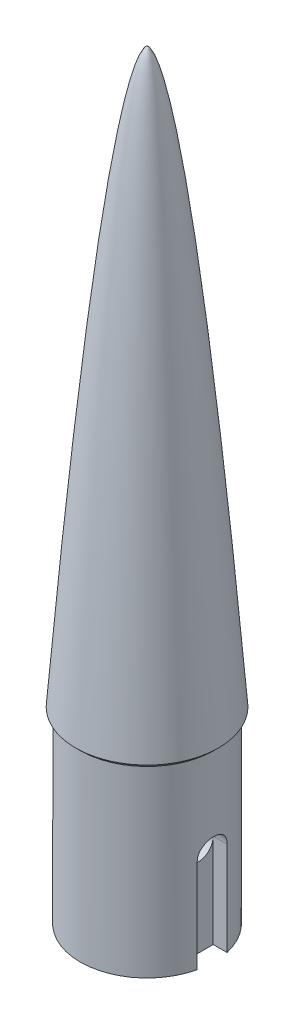
ISO-10303-21;
HEADER;
FILE_DESCRIPTION(('STEP AP214'),'2;1');
FILE_NAME('part.step','',(''),(''),'','','');
FILE_SCHEMA(('AUTOMOTIVE_DESIGN { 1 0 10303 214 1 1 1 1 }'));
ENDSEC;
DATA;
#1=APPLICATION_CONTEXT('core data for automotive mechanical design processes');
#2=APPLICATION_PROTOCOL_DEFINITION('international standard','automotive_design',2000,#1);
#3=PRODUCT_CONTEXT('',#1,'mechanical');
#4=PRODUCT('Part','Part','',(#3));
#5=PRODUCT_RELATED_PRODUCT_CATEGORY('part','',(#4));
#6=PRODUCT_DEFINITION_FORMATION('','',#4);
#7=PRODUCT_DEFINITION_CONTEXT('part definition',#1,'design');
#8=PRODUCT_DEFINITION('design','',#6,#7);
#9=PRODUCT_DEFINITION_SHAPE('','',#8);
#10=(LENGTH_UNIT() NAMED_UNIT(*) SI_UNIT(.MILLI.,.METRE.));
#11=(NAMED_UNIT(*) PLANE_ANGLE_UNIT() SI_UNIT($,.RADIAN.));
#12=(NAMED_UNIT(*) SI_UNIT($,.STERADIAN.) SOLID_ANGLE_UNIT());
#13=UNCERTAINTY_MEASURE_WITH_UNIT(LENGTH_MEASURE(1.E-05),#10,'distance_accuracy_value','');
#14=(GEOMETRIC_REPRESENTATION_CONTEXT(3) GLOBAL_UNCERTAINTY_ASSIGNED_CONTEXT((#13)) GLOBAL_UNIT_ASSIGNED_CONTEXT((#10,
#11,#12)) REPRESENTATION_CONTEXT('',''));
#15=CARTESIAN_POINT('',(0.,0.,0.));
#16=DIRECTION('',(0.,0.,1.));
#17=DIRECTION('',(1.,0.,0.));
#18=AXIS2_PLACEMENT_3D('',#15,#16,#17);
#19=CARTESIAN_POINT('',(0.,-25.,0.));
#20=DIRECTION('',(0.,1.,0.));
#21=DIRECTION('',(0.,0.,1.));
#22=AXIS2_PLACEMENT_3D('',#19,#20,#21);
#23=CYLINDRICAL_SURFACE('',#22,8.895);
#24=CARTESIAN_POINT('',(0.,-0.600000000000003,0.));
#25=DIRECTION('',(0.,-1.,0.));
#26=DIRECTION('',(0.,0.,-1.));
#27=AXIS2_PLACEMENT_3D('',#24,#25,#26);
#28=CIRCLE('',#27,8.895);
#29=CARTESIAN_POINT('',(0.,-0.600000000000003,-8.895));
#30=VERTEX_POINT('',#29);
#31=EDGE_CURVE('E11',#30,#30,#28,.T.);
#32=ORIENTED_EDGE('',*,*,#31,.T.);
#33=EDGE_LOOP('',(#32));
#34=FACE_BOUND('',#33,.T.);
#35=DIRECTION('',(0.,-1.,0.));
#36=VECTOR('',#35,1.);
#37=CARTESIAN_POINT('',(-8.67082930632215,-12.5,-1.98437499999999));
#38=LINE('',#37,#36);
#39=CARTESIAN_POINT('',(-8.67082930632215,-12.5,-1.984375));
#40=VERTEX_POINT('',#39);
#41=CARTESIAN_POINT('',(-8.67082930632215,-25.,-1.98437499999999));
#42=VERTEX_POINT('',#41);
#43=EDGE_CURVE('E210',#40,#42,#38,.T.);
#44=ORIENTED_EDGE('',*,*,#43,.F.);
#45=CARTESIAN_POINT('',(-8.895,-10.515625,0.));
#46=CARTESIAN_POINT('',(-8.89499798053136,-10.5156286782961,-0.110003108531044));
#47=CARTESIAN_POINT('',(-8.89293872905295,-10.5248028437771,-0.220050190385659));
#48=CARTESIAN_POINT('',(-8.88492294410009,-10.5612168017032,-0.437014773196951));
#49=CARTESIAN_POINT('',(-8.87896370197709,-10.5884691501126,-0.543930045069365));
#50=CARTESIAN_POINT('',(-8.86381097564101,-10.66014046251,-0.751464389222808));
#51=CARTESIAN_POINT('',(-8.85462093856362,-10.7045411348459,-0.852090038043748));
#52=CARTESIAN_POINT('',(-8.83399673910637,-10.809189812261,-1.04446068714721));
#53=CARTESIAN_POINT('',(-8.82256261666939,-10.8694375352822,-1.13620584545178));
#54=CARTESIAN_POINT('',(-8.79848845487047,-11.0051316026497,-1.30974205494041));
#55=CARTESIAN_POINT('',(-8.78583296110134,-11.0807914141361,-1.39136405863448));
#56=CARTESIAN_POINT('',(-8.76085045969245,-11.2447038420026,-1.54087074401027));
#57=CARTESIAN_POINT('',(-8.74852348238285,-11.332957616368,-1.60875416107165));
#58=CARTESIAN_POINT('',(-8.72544092397066,-11.520810939859,-1.72960902031442));
#59=CARTESIAN_POINT('',(-8.71470512331446,-11.6205296910602,-1.78239929438126));
#60=CARTESIAN_POINT('',(-8.69624278881732,-11.8277023668504,-1.87040686218199));
#61=CARTESIAN_POINT('',(-8.68851587956583,-11.9351553244818,-1.90562634832583));
#62=CARTESIAN_POINT('',(-8.67710379688232,-12.1529089981679,-1.95693151039241));
#63=CARTESIAN_POINT('',(-8.67335534128796,-12.2631356576469,-1.9733171227466));
#64=CARTESIAN_POINT('',(-8.67013460913494,-12.4848322544565,-1.98742225140913));
#65=CARTESIAN_POINT('',(-8.67066178498573,-12.5963020307519,-1.98514415802333));
#66=CARTESIAN_POINT('',(-8.6758755128654,-12.8150819521088,-1.96222763913715));
#67=CARTESIAN_POINT('',(-8.68048286491296,-12.9224308899092,-1.94193880078754));
#68=CARTESIAN_POINT('',(-8.69321246305035,-13.1321618701326,-1.88413107223078));
#69=CARTESIAN_POINT('',(-8.70133491344556,-13.2345436234669,-1.84661118050843));
#70=CARTESIAN_POINT('',(-8.72025684575896,-13.4324107413625,-1.75508849250558));
#71=CARTESIAN_POINT('',(-8.73107785800529,-13.5278322502844,-1.70095228060515));
#72=CARTESIAN_POINT('',(-8.75416459631689,-13.7083654708171,-1.57782741855743));
#73=CARTESIAN_POINT('',(-8.76643052669428,-13.7934757209513,-1.50883666682662));
#74=CARTESIAN_POINT('',(-8.79136402902234,-13.9529819654673,-1.35611581093398));
#75=CARTESIAN_POINT('',(-8.8040344247618,-14.0270934621295,-1.27208872607875));
#76=CARTESIAN_POINT('',(-8.82809796612522,-14.1602203300518,-1.09265382918496));
#77=CARTESIAN_POINT('',(-8.83949108676558,-14.2192354060537,-0.99724579460952));
#78=CARTESIAN_POINT('',(-8.85975573704167,-14.3205689320845,-0.797402322384055));
#79=CARTESIAN_POINT('',(-8.86862144653922,-14.3628489299928,-0.692946759215006));
#80=CARTESIAN_POINT('',(-8.88278925247284,-14.4291766978656,-0.478171595830713));
#81=CARTESIAN_POINT('',(-8.88809188846723,-14.4532272283998,-0.367852886206666));
#82=CARTESIAN_POINT('',(-8.89445888054048,-14.4819968395156,-0.146922244637292));
#83=CARTESIAN_POINT('',(-8.89560839126927,-14.487104381303,-0.0363632839080309));
#84=CARTESIAN_POINT('',(-8.89377875578923,-14.4788975892449,0.184028216567811));
#85=CARTESIAN_POINT('',(-8.8907999015053,-14.4655845579548,0.293860807125686));
#86=CARTESIAN_POINT('',(-8.88110209755264,-14.4212364374193,0.508386435136476));
#87=CARTESIAN_POINT('',(-8.87442639805636,-14.3904061793644,0.613123945630332));
#88=CARTESIAN_POINT('',(-8.85808259752387,-14.3121269856043,0.815940337496674));
#89=CARTESIAN_POINT('',(-8.84841423460527,-14.2646765954544,0.914018635217614));
#90=CARTESIAN_POINT('',(-8.82694819211914,-14.1537022358176,1.10233086452755));
#91=CARTESIAN_POINT('',(-8.81512120261388,-14.0899514567944,1.1924277186746));
#92=CARTESIAN_POINT('',(-8.79070766484064,-13.9484834474263,1.36078396392382));
#93=CARTESIAN_POINT('',(-8.77812101382286,-13.8707643249358,1.43904174866253));
#94=CARTESIAN_POINT('',(-8.75331093693519,-13.7017800928848,1.58304298834678));
#95=CARTESIAN_POINT('',(-8.74109914583823,-13.6102832900571,1.64851693602485));
#96=CARTESIAN_POINT('',(-8.71869698047453,-13.4173649355546,1.76317168339184));
#97=CARTESIAN_POINT('',(-8.70850651768816,-13.315943818784,1.81235319663538));
#98=CARTESIAN_POINT('',(-8.69140054463049,-13.1066041991113,1.89268852324433));
#99=CARTESIAN_POINT('',(-8.68446640876592,-12.9987267288714,1.92394509722755));
#100=CARTESIAN_POINT('',(-8.67462629679212,-12.7790753551192,1.96784118701104));
#101=CARTESIAN_POINT('',(-8.67171964652347,-12.6673021069317,1.98048381861487));
#102=CARTESIAN_POINT('',(-8.67030729710035,-12.4457524437848,1.9866564116767));
#103=CARTESIAN_POINT('',(-8.67170310734381,-12.3359883589578,1.98061409297813));
#104=CARTESIAN_POINT('',(-8.67851500496339,-12.1190849742809,1.95054750257742));
#105=CARTESIAN_POINT('',(-8.68393104095299,-12.0119456408994,1.92652346071756));
#106=CARTESIAN_POINT('',(-8.6981241844418,-11.8036893505729,1.86138575645093));
#107=CARTESIAN_POINT('',(-8.70688857054173,-11.7025512531436,1.82033672721598));
#108=CARTESIAN_POINT('',(-8.72679539432478,-11.5085347915276,1.72236893705458));
#109=CARTESIAN_POINT('',(-8.73793809113817,-11.4156573289467,1.66544844663638));
#110=CARTESIAN_POINT('',(-8.76163848646004,-11.238695474782,1.53594515186167));
#111=CARTESIAN_POINT('',(-8.77422098481682,-11.154836679788,1.46305855847869));
#112=CARTESIAN_POINT('',(-8.79921922589108,-11.0004001651611,1.30430465490752));
#113=CARTESIAN_POINT('',(-8.81163492929224,-10.9298255275292,1.21843434073407));
#114=CARTESIAN_POINT('',(-8.83510136371243,-10.8030382120514,1.03474108869537));
#115=CARTESIAN_POINT('',(-8.84613120897754,-10.7470341562857,0.936771332481138));
#116=CARTESIAN_POINT('',(-8.86537241774909,-10.6523773860926,0.732581640881906));
#117=CARTESIAN_POINT('',(-8.87358609932992,-10.6137103928671,0.626368579579056));
#118=CARTESIAN_POINT('',(-8.88483654653533,-10.5615673365609,0.43340420838887));
#119=CARTESIAN_POINT('',(-8.88862390497389,-10.5443723842688,0.347682052709739));
#120=CARTESIAN_POINT('',(-8.8937063738634,-10.5214000285145,0.174649120553264));
#121=CARTESIAN_POINT('',(-8.89500160338379,-10.5156220795683,0.0873384201749424));
#122=CARTESIAN_POINT('',(-8.895,-10.515625,0.));
#123=B_SPLINE_CURVE_WITH_KNOTS('',3,(#45,#46,#47,#48,#49,#50,#51,#52,#53,#54,#55,#56,#57,#58,
#59,#60,#61,#62,#63,#64,#65,#66,#67,#68,#69,#70,#71,#72,#73,#74,#75,#76,#77,#78,#79,#80,#81,#82,
#83,#84,#85,#86,#87,#88,#89,#90,#91,#92,#93,#94,#95,#96,#97,#98,#99,#100,#101,#102,#103,#104,
#105,#106,#107,#108,#109,#110,#111,#112,#113,#114,#115,#116,#117,#118,#119,#120,#121,#122),
.UNSPECIFIED.,.T.,.F.,(4,2,2,2,2,2,2,2,2,2,2,2,2,2,2,2,2,2,2,2,2,2,2,2,2,2,2,2,2,2,2,2,2,2,2,2,
2,2,4),(0.,0.32968958471569,0.659608391077071,0.989176249620352,1.31873824265806,
1.65322013476703,1.98773280154188,2.32610663322488,2.6644382334597,2.99730368340978,
3.33012650314447,3.65662716066737,3.98314679768962,4.31235992028412,4.64161964977686,
4.97829541698964,5.31497776845579,5.65242928429447,5.98982968812842,6.32027155964406,
6.65069006614927,6.9773221968005,7.30398291850589,7.63546294699817,7.96698791151875,
8.30488633992517,8.64276996754305,8.97869668766252,9.31456717032856,9.64280656540119,
9.97104176499135,10.2980421054524,10.6250780926347,10.9589814011184,11.2929620818613,
11.631489944489,11.9697384812382,12.2315123866697,12.493273784704),.UNSPECIFIED.);
#124=CARTESIAN_POINT('',(-8.67082930632215,-12.5,1.984375));
#125=VERTEX_POINT('',#124);
#126=EDGE_CURVE('E158',#125,#40,#123,.T.);
#127=ORIENTED_EDGE('',*,*,#126,.F.);
#128=DIRECTION('',(0.,-1.,0.));
#129=VECTOR('',#128,1.);
#130=CARTESIAN_POINT('',(-8.67082930632215,-12.5,1.984375));
#131=LINE('',#130,#129);
#132=CARTESIAN_POINT('',(-8.67082930632215,-25.,1.984375));
#133=VERTEX_POINT('',#132);
#134=EDGE_CURVE('E214',#125,#133,#131,.T.);
#135=ORIENTED_EDGE('',*,*,#134,.T.);
#136=CARTESIAN_POINT('',(0.,-25.,0.));
#137=DIRECTION('',(0.,1.,0.));
#138=DIRECTION('',(0.,0.,1.));
#139=AXIS2_PLACEMENT_3D('',#136,#137,#138);
#140=CIRCLE('',#139,8.895);
#141=CARTESIAN_POINT('',(8.67082930632215,-25.,1.984375));
#142=VERTEX_POINT('',#141);
#143=EDGE_CURVE('E223',#133,#142,#140,.T.);
#144=ORIENTED_EDGE('',*,*,#143,.T.);
#145=DIRECTION('',(0.,-1.,0.));
#146=VECTOR('',#145,1.);
#147=CARTESIAN_POINT('',(8.67082930632215,-12.5,1.984375));
#148=LINE('',#147,#146);
#149=CARTESIAN_POINT('',(8.67082930632215,-12.5,1.984375));
#150=VERTEX_POINT('',#149);
#151=EDGE_CURVE('E61',#150,#142,#148,.T.);
#152=ORIENTED_EDGE('',*,*,#151,.F.);
#153=CARTESIAN_POINT('',(8.67082930632215,-12.5,-1.984375));
#154=CARTESIAN_POINT('',(8.67083152693427,-12.3900352924012,-1.98437129476868));
#155=CARTESIAN_POINT('',(8.67294398159313,-12.2800265459929,-1.97520331559507));
#156=CARTESIAN_POINT('',(8.68114924080244,-12.0631415333078,-1.9388161542682));
#157=CARTESIAN_POINT('',(8.687244848201,-11.956267528248,-1.91158426077147));
#158=CARTESIAN_POINT('',(8.70269247518692,-11.748820633369,-1.83997273746253));
#159=CARTESIAN_POINT('',(8.71204083806803,-11.6482408168817,-1.79561235715901));
#160=CARTESIAN_POINT('',(8.73293623267991,-11.4559475998378,-1.69105869172377));
#161=CARTESIAN_POINT('',(8.74448323779282,-11.3642340919615,-1.63086559826731));
#162=CARTESIAN_POINT('',(8.76870152698746,-11.190664815864,-1.49522783567887));
#163=CARTESIAN_POINT('',(8.78138768085908,-11.1089875068265,-1.41955741552215));
#164=CARTESIAN_POINT('',(8.80632483899608,-10.959373320034,-1.25560020996667));
#165=CARTESIAN_POINT('',(8.81857580851969,-10.8914375372732,-1.16731242010812));
#166=CARTESIAN_POINT('',(8.8414245341093,-10.7705257147047,-0.979426653986215));
#167=CARTESIAN_POINT('',(8.85200269761223,-10.7177218091067,-0.879715314874414));
#168=CARTESIAN_POINT('',(8.87014575131516,-10.6296870280497,-0.672558617309702));
#169=CARTESIAN_POINT('',(8.8777109934971,-10.5944540997552,-0.56511416400382));
#170=CARTESIAN_POINT('',(8.88887072235122,-10.5431240620808,-0.347397468059264));
#171=CARTESIAN_POINT('',(8.89252784470798,-10.5267247747917,-0.237199733411299));
#172=CARTESIAN_POINT('',(8.89567645545256,-10.5125822573189,-0.0155605825450066));
#173=CARTESIAN_POINT('',(8.89516843879117,-10.5148368104668,0.0958806843305372));
#174=CARTESIAN_POINT('',(8.89009171695082,-10.5377139363359,0.31475870560092));
#175=CARTESIAN_POINT('',(8.88559503342556,-10.5580107416537,0.422231426260748));
#176=CARTESIAN_POINT('',(8.8731285194068,-10.6158765069307,0.63220575827785));
#177=CARTESIAN_POINT('',(8.86515852778899,-10.6534462681744,0.734707138772998));
#178=CARTESIAN_POINT('',(8.84652583210922,-10.7450763392216,0.932727372605715));
#179=CARTESIAN_POINT('',(8.83584323372576,-10.7992591265551,1.02818760316908));
#180=CARTESIAN_POINT('',(8.81295504188348,-10.9224856773742,1.2087789663073));
#181=CARTESIAN_POINT('',(8.80074923327929,-10.9915315411911,1.29390863638836));
#182=CARTESIAN_POINT('',(8.77584357058241,-11.1442943709138,1.45336071135604));
#183=CARTESIAN_POINT('',(8.76313874101006,-11.2282964215203,1.5274094616731));
#184=CARTESIAN_POINT('',(8.73891357366072,-11.4076579397835,1.66042127107666));
#185=CARTESIAN_POINT('',(8.72739327066983,-11.5030177408069,1.71938388720298));
#186=CARTESIAN_POINT('',(8.70682769295961,-11.7028425850512,1.82067818880462));
#187=CARTESIAN_POINT('',(8.69779041740815,-11.8073356589106,1.86295631105176));
#188=CARTESIAN_POINT('',(8.68332365321309,-12.022193123648,1.92926911648296));
#189=CARTESIAN_POINT('',(8.67789356668125,-12.1325565382453,1.95330682309304));
#190=CARTESIAN_POINT('',(8.67137842965835,-12.3535164219845,1.98202813124953));
#191=CARTESIAN_POINT('',(8.6702037566994,-12.4640584104577,1.98711100551234));
#192=CARTESIAN_POINT('',(8.67209039478514,-12.6844102825169,1.97886095731595));
#193=CARTESIAN_POINT('',(8.67515140212929,-12.7942202180243,1.96552935518464));
#194=CARTESIAN_POINT('',(8.68507970183092,-13.008588609668,1.92117571919051));
#195=CARTESIAN_POINT('',(8.69189929584423,-13.1131953191398,1.8903752346446));
#196=CARTESIAN_POINT('',(8.70853304572482,-13.3157631209793,1.81219878075513));
#197=CARTESIAN_POINT('',(8.71834749764175,-13.4137235551742,1.76482117265091));
#198=CARTESIAN_POINT('',(8.74006093984554,-13.6019411777236,1.65396154223488));
#199=CARTESIAN_POINT('',(8.75199070504297,-13.6920504352035,1.59023451518154));
#200=CARTESIAN_POINT('',(8.7765101984565,-13.8604425592094,1.4488041612309));
#201=CARTESIAN_POINT('',(8.78910001194908,-13.9387238925018,1.37109902523044));
#202=CARTESIAN_POINT('',(8.81381758079177,-14.0827966953209,1.20210799703321));
#203=CARTESIAN_POINT('',(8.82593157346983,-14.14831541272,1.11058721230565));
#204=CARTESIAN_POINT('',(8.84807556919855,-14.2630486894093,0.91760694147292));
#205=CARTESIAN_POINT('',(8.85810567158719,-14.3122640259399,0.816147929457443));
#206=CARTESIAN_POINT('',(8.87489393112164,-14.3926180815481,0.606815775294063));
#207=CARTESIAN_POINT('',(8.88167322724541,-14.423873857297,0.498989339167028));
#208=CARTESIAN_POINT('',(8.89128759699143,-14.4677855598397,0.279447263775833));
#209=CARTESIAN_POINT('',(8.89412326837703,-14.4804443055345,0.167732216568148));
#210=CARTESIAN_POINT('',(8.89551225388667,-14.4866716096712,-0.0538303410463871));
#211=CARTESIAN_POINT('',(8.89415677257247,-14.4806467378316,-0.1636660480899));
#212=CARTESIAN_POINT('',(8.88751206547856,-14.4505901194767,-0.380717396055891));
#213=CARTESIAN_POINT('',(8.88222291602629,-14.4265587223531,-0.487933087774485));
#214=CARTESIAN_POINT('',(8.86831291596493,-14.3613693329617,-0.696371660604404));
#215=CARTESIAN_POINT('',(8.85970370424092,-14.3202711322204,-0.797614067913526));
#216=CARTESIAN_POINT('',(8.84007111469181,-14.2221722616271,-0.991819184416284));
#217=CARTESIAN_POINT('',(8.82904749249992,-14.1651699819348,-1.08478105418124));
#218=CARTESIAN_POINT('',(8.80551621508588,-14.0355666300762,-1.26176241652204));
#219=CARTESIAN_POINT('',(8.79298364506869,-13.9626809241806,-1.34557017665365));
#220=CARTESIAN_POINT('',(8.76797805507896,-13.8039510336438,-1.49990415519922));
#221=CARTESIAN_POINT('',(8.7555050502752,-13.7181037126502,-1.57042714975871));
#222=CARTESIAN_POINT('',(8.73183513193552,-13.5344380779377,-1.69714603015807));
#223=CARTESIAN_POINT('',(8.72065858524308,-13.4364686619124,-1.75312694377475));
#224=CARTESIAN_POINT('',(8.7011051990314,-13.2322823615859,-1.84774053682795));
#225=CARTESIAN_POINT('',(8.69272603418347,-13.126072418212,-1.88638763425605));
#226=CARTESIAN_POINT('',(8.68123438698859,-12.9331580464439,-1.93848519859973));
#227=CARTESIAN_POINT('',(8.67735881646133,-12.847485490319,-1.95566030472962));
#228=CARTESIAN_POINT('',(8.67215546197685,-12.6745511498479,-1.97860637521381));
#229=CARTESIAN_POINT('',(8.67082754361105,-12.5872894495867,-1.98437794119458));
#230=CARTESIAN_POINT('',(8.67082930632215,-12.5,-1.984375));
#231=B_SPLINE_CURVE_WITH_KNOTS('',3,(#153,#154,#155,#156,#157,#158,#159,#160,#161,#162,#163,
#164,#165,#166,#167,#168,#169,#170,#171,#172,#173,#174,#175,#176,#177,#178,#179,#180,#181,#182,
#183,#184,#185,#186,#187,#188,#189,#190,#191,#192,#193,#194,#195,#196,#197,#198,#199,#200,#201,
#202,#203,#204,#205,#206,#207,#208,#209,#210,#211,#212,#213,#214,#215,#216,#217,#218,#219,#220,
#221,#222,#223,#224,#225,#226,#227,#228,#229,#230),.UNSPECIFIED.,.T.,.F.,(4,2,2,2,2,2,2,2,2,2,2,
2,2,2,2,2,2,2,2,2,2,2,2,2,2,2,2,2,2,2,2,2,2,2,2,2,2,2,4),(0.,0.329574133527324,
0.659380430494616,0.988817154975628,1.31824989138673,1.6528827972829,1.98754235792109,
2.32587008991828,2.66415828546683,2.99693943397993,3.32968103809655,3.65653406946799,
3.98340226493483,4.31274068542326,4.6421256759768,4.97863673959058,5.31515768273329,
5.65275035769749,5.99028706301795,6.32067223910689,6.65103372763026,6.97729620213301,
7.30359093900236,7.63509437723089,7.96664075087856,8.30464018838773,8.64262350993627,
8.97837818149084,9.31408195476448,9.64253221398148,9.97097610023751,10.2982789020109,
10.6256148460068,10.9593860612475,11.2932381697132,11.6317758832356,11.9700314818907,
12.2316596280387,12.4932739708748),.UNSPECIFIED.);
#232=CARTESIAN_POINT('',(8.67082930632215,-12.5,-1.984375));
#233=VERTEX_POINT('',#232);
#234=EDGE_CURVE('E131',#233,#150,#231,.T.);
#235=ORIENTED_EDGE('',*,*,#234,.F.);
#236=DIRECTION('',(0.,-1.,0.));
#237=VECTOR('',#236,1.);
#238=CARTESIAN_POINT('',(8.67082930632215,-12.5,-1.98437499999999));
#239=LINE('',#238,#237);
#240=CARTESIAN_POINT('',(8.67082930632215,-25.,-1.98437499999999));
#241=VERTEX_POINT('',#240);
#242=EDGE_CURVE('E173',#233,#241,#239,.T.);
#243=ORIENTED_EDGE('',*,*,#242,.T.);
#244=EDGE_CURVE('E213',#241,#42,#140,.T.);
#245=ORIENTED_EDGE('',*,*,#244,.T.);
#246=EDGE_LOOP('',(#44,#127,#135,#144,#152,#235,#243,#245));
#247=FACE_BOUND('',#246,.T.);
#248=ADVANCED_FACE('F45',(#34,#247),#23,.T.);
#249=CARTESIAN_POINT('',(0.,-25.,0.));
#250=DIRECTION('',(0.,1.,0.));
#251=DIRECTION('',(0.,0.,1.));
#252=AXIS2_PLACEMENT_3D('',#249,#250,#251);
#253=PLANE('',#252);
#254=DIRECTION('',(-1.,0.,0.));
#255=VECTOR('',#254,1.);
#256=CARTESIAN_POINT('',(6.83125,-25.,-1.984375));
#257=LINE('',#256,#255);
#258=CARTESIAN_POINT('',(6.83125,-25.,-1.984375));
#259=VERTEX_POINT('',#258);
#260=EDGE_CURVE('E164',#241,#259,#257,.T.);
#261=ORIENTED_EDGE('',*,*,#260,.T.);
#262=DIRECTION('',(0.,0.,1.));
#263=VECTOR('',#262,1.);
#264=CARTESIAN_POINT('',(6.83125,-25.,1.984375));
#265=LINE('',#264,#263);
#266=CARTESIAN_POINT('',(6.83125,-25.,1.984375));
#267=VERTEX_POINT('',#266);
#268=EDGE_CURVE('E170',#259,#267,#265,.T.);
#269=ORIENTED_EDGE('',*,*,#268,.T.);
#270=DIRECTION('',(1.,0.,0.));
#271=VECTOR('',#270,1.);
#272=CARTESIAN_POINT('',(6.83125,-25.,1.984375));
#273=LINE('',#272,#271);
#274=EDGE_CURVE('E177',#267,#142,#273,.T.);
#275=ORIENTED_EDGE('',*,*,#274,.T.);
#276=ORIENTED_EDGE('',*,*,#143,.F.);
#277=DIRECTION('',(-1.,0.,0.));
#278=VECTOR('',#277,1.);
#279=CARTESIAN_POINT('',(-6.83125,-25.,1.984375));
#280=LINE('',#279,#278);
#281=CARTESIAN_POINT('',(-6.83125,-25.,1.984375));
#282=VERTEX_POINT('',#281);
#283=EDGE_CURVE('E198',#282,#133,#280,.T.);
#284=ORIENTED_EDGE('',*,*,#283,.F.);
#285=DIRECTION('',(0.,0.,1.));
#286=VECTOR('',#285,1.);
#287=CARTESIAN_POINT('',(-6.83125,-25.,1.984375));
#288=LINE('',#287,#286);
#289=CARTESIAN_POINT('',(-6.83125,-25.,-1.984375));
#290=VERTEX_POINT('',#289);
#291=EDGE_CURVE('E204',#290,#282,#288,.T.);
#292=ORIENTED_EDGE('',*,*,#291,.F.);
#293=DIRECTION('',(1.,0.,0.));
#294=VECTOR('',#293,1.);
#295=CARTESIAN_POINT('',(-6.83125,-25.,-1.984375));
#296=LINE('',#295,#294);
#297=EDGE_CURVE('E69',#42,#290,#296,.T.);
#298=ORIENTED_EDGE('',*,*,#297,.F.);
#299=ORIENTED_EDGE('',*,*,#244,.F.);
#300=EDGE_LOOP('',(#261,#269,#275,#276,#284,#292,#298,#299));
#301=FACE_BOUND('',#300,.T.);
#302=ADVANCED_FACE('F236',(#301),#253,.F.);
#303=CARTESIAN_POINT('',(-6.83125,-12.5,-1.984375));
#304=DIRECTION('',(0.,0.,-1.));
#305=DIRECTION('',(-1.,0.,0.));
#306=AXIS2_PLACEMENT_3D('',#303,#304,#305);
#307=PLANE('',#306);
#308=ORIENTED_EDGE('',*,*,#297,.T.);
#309=DIRECTION('',(0.,-1.,0.));
#310=VECTOR('',#309,1.);
#311=CARTESIAN_POINT('',(-6.83125,-12.5,-1.984375));
#312=LINE('',#311,#310);
#313=CARTESIAN_POINT('',(-6.83125,-12.5,-1.984375));
#314=VERTEX_POINT('',#313);
#315=EDGE_CURVE('E201',#314,#290,#312,.T.);
#316=ORIENTED_EDGE('',*,*,#315,.F.);
#317=DIRECTION('',(1.,0.,0.));
#318=VECTOR('',#317,1.);
#319=CARTESIAN_POINT('',(-6.83125,-12.5,-1.984375));
#320=LINE('',#319,#318);
#321=EDGE_CURVE('E194',#40,#314,#320,.T.);
#322=ORIENTED_EDGE('',*,*,#321,.F.);
#323=ORIENTED_EDGE('',*,*,#43,.T.);
#324=EDGE_LOOP('',(#308,#316,#322,#323));
#325=FACE_BOUND('',#324,.T.);
#326=ADVANCED_FACE('F242',(#325),#307,.F.);
#327=CARTESIAN_POINT('',(-6.83125,-12.5,1.984375));
#328=DIRECTION('',(0.,0.,1.));
#329=DIRECTION('',(1.,0.,0.));
#330=AXIS2_PLACEMENT_3D('',#327,#328,#329);
#331=PLANE('',#330);
#332=ORIENTED_EDGE('',*,*,#283,.T.);
#333=ORIENTED_EDGE('',*,*,#134,.F.);
#334=DIRECTION('',(-1.,0.,0.));
#335=VECTOR('',#334,1.);
#336=CARTESIAN_POINT('',(-6.83125,-12.5,1.984375));
#337=LINE('',#336,#335);
#338=CARTESIAN_POINT('',(-6.83125,-12.5,1.984375));
#339=VERTEX_POINT('',#338);
#340=EDGE_CURVE('E197',#339,#125,#337,.T.);
#341=ORIENTED_EDGE('',*,*,#340,.F.);
#342=DIRECTION('',(0.,-1.,0.));
#343=VECTOR('',#342,1.);
#344=CARTESIAN_POINT('',(-6.83125,-12.5,1.984375));
#345=LINE('',#344,#343);
#346=EDGE_CURVE('E218',#339,#282,#345,.T.);
#347=ORIENTED_EDGE('',*,*,#346,.T.);
#348=EDGE_LOOP('',(#332,#333,#341,#347));
#349=FACE_BOUND('',#348,.T.);
#350=ADVANCED_FACE('F262',(#349),#331,.F.);
#351=CARTESIAN_POINT('',(-6.83125,-12.5,1.984375));
#352=DIRECTION('',(1.,0.,0.));
#353=DIRECTION('',(0.,0.,-1.));
#354=AXIS2_PLACEMENT_3D('',#351,#352,#353);
#355=PLANE('',#354);
#356=ORIENTED_EDGE('',*,*,#346,.F.);
#357=CARTESIAN_POINT('',(-6.83125,-12.5,0.));
#358=DIRECTION('',(1.,0.,0.));
#359=DIRECTION('',(0.,0.,-1.));
#360=AXIS2_PLACEMENT_3D('',#357,#358,#359);
#361=CIRCLE('',#360,1.984375);
#362=EDGE_CURVE('E144',#339,#314,#361,.T.);
#363=ORIENTED_EDGE('',*,*,#362,.T.);
#364=ORIENTED_EDGE('',*,*,#315,.T.);
#365=ORIENTED_EDGE('',*,*,#291,.T.);
#366=EDGE_LOOP('',(#356,#363,#364,#365));
#367=FACE_BOUND('',#366,.T.);
#368=ADVANCED_FACE('F255',(#367),#355,.F.);
#369=CARTESIAN_POINT('',(6.83125,-12.5,-1.984375));
#370=DIRECTION('',(0.,0.,1.));
#371=DIRECTION('',(1.,0.,0.));
#372=AXIS2_PLACEMENT_3D('',#369,#370,#371);
#373=PLANE('',#372);
#374=ORIENTED_EDGE('',*,*,#260,.F.);
#375=ORIENTED_EDGE('',*,*,#242,.F.);
#376=DIRECTION('',(-1.,0.,0.));
#377=VECTOR('',#376,1.);
#378=CARTESIAN_POINT('',(6.83125,-12.5,-1.984375));
#379=LINE('',#378,#377);
#380=CARTESIAN_POINT('',(6.83125,-12.5,-1.984375));
#381=VERTEX_POINT('',#380);
#382=EDGE_CURVE('E165',#233,#381,#379,.T.);
#383=ORIENTED_EDGE('',*,*,#382,.T.);
#384=DIRECTION('',(0.,-1.,0.));
#385=VECTOR('',#384,1.);
#386=CARTESIAN_POINT('',(6.83125,-12.5,-1.984375));
#387=LINE('',#386,#385);
#388=EDGE_CURVE('E182',#381,#259,#387,.T.);
#389=ORIENTED_EDGE('',*,*,#388,.T.);
#390=EDGE_LOOP('',(#374,#375,#383,#389));
#391=FACE_BOUND('',#390,.T.);
#392=ADVANCED_FACE('F270',(#391),#373,.T.);
#393=CARTESIAN_POINT('',(6.83125,-12.5,1.984375));
#394=DIRECTION('',(1.,0.,0.));
#395=DIRECTION('',(0.,0.,-1.));
#396=AXIS2_PLACEMENT_3D('',#393,#394,#395);
#397=PLANE('',#396);
#398=CARTESIAN_POINT('',(6.83125,-12.5,0.));
#399=DIRECTION('',(1.,0.,0.));
#400=DIRECTION('',(0.,0.,-1.));
#401=AXIS2_PLACEMENT_3D('',#398,#399,#400);
#402=CIRCLE('',#401,1.984375);
#403=CARTESIAN_POINT('',(6.83125,-12.5,1.984375));
#404=VERTEX_POINT('',#403);
#405=EDGE_CURVE('E126',#404,#381,#402,.T.);
#406=ORIENTED_EDGE('',*,*,#405,.F.);
#407=DIRECTION('',(0.,-1.,0.));
#408=VECTOR('',#407,1.);
#409=CARTESIAN_POINT('',(6.83125,-12.5,1.984375));
#410=LINE('',#409,#408);
#411=EDGE_CURVE('E186',#404,#267,#410,.T.);
#412=ORIENTED_EDGE('',*,*,#411,.T.);
#413=ORIENTED_EDGE('',*,*,#268,.F.);
#414=ORIENTED_EDGE('',*,*,#388,.F.);
#415=EDGE_LOOP('',(#406,#412,#413,#414));
#416=FACE_BOUND('',#415,.T.);
#417=ADVANCED_FACE('F155',(#416),#397,.T.);
#418=CARTESIAN_POINT('',(6.83125,-12.5,1.984375));
#419=DIRECTION('',(0.,0.,-1.));
#420=DIRECTION('',(-1.,0.,0.));
#421=AXIS2_PLACEMENT_3D('',#418,#419,#420);
#422=PLANE('',#421);
#423=ORIENTED_EDGE('',*,*,#274,.F.);
#424=ORIENTED_EDGE('',*,*,#411,.F.);
#425=DIRECTION('',(1.,0.,0.));
#426=VECTOR('',#425,1.);
#427=CARTESIAN_POINT('',(6.83125,-12.5,1.984375));
#428=LINE('',#427,#426);
#429=EDGE_CURVE('E169',#404,#150,#428,.T.);
#430=ORIENTED_EDGE('',*,*,#429,.T.);
#431=ORIENTED_EDGE('',*,*,#151,.T.);
#432=EDGE_LOOP('',(#423,#424,#430,#431));
#433=FACE_BOUND('',#432,.T.);
#434=ADVANCED_FACE('F153',(#433),#422,.T.);
#435=CARTESIAN_POINT('',(-8.895,-12.5,0.));
#436=DIRECTION('',(1.,0.,0.));
#437=DIRECTION('',(0.,0.,-1.));
#438=AXIS2_PLACEMENT_3D('',#435,#436,#437);
#439=CYLINDRICAL_SURFACE('',#438,1.984375);
#440=ORIENTED_EDGE('',*,*,#126,.T.);
#441=ORIENTED_EDGE('',*,*,#321,.T.);
#442=ORIENTED_EDGE('',*,*,#362,.F.);
#443=ORIENTED_EDGE('',*,*,#340,.T.);
#444=EDGE_LOOP('',(#440,#441,#442,#443));
#445=FACE_BOUND('',#444,.T.);
#446=ORIENTED_EDGE('',*,*,#234,.T.);
#447=ORIENTED_EDGE('',*,*,#429,.F.);
#448=ORIENTED_EDGE('',*,*,#405,.T.);
#449=ORIENTED_EDGE('',*,*,#382,.F.);
#450=EDGE_LOOP('',(#446,#447,#448,#449));
#451=FACE_BOUND('',#450,.T.);
#452=ADVANCED_FACE('F148',(#445,#451),#439,.F.);
#453=CARTESIAN_POINT('',(9.50000000107243,-6.62277391187374E-11,0.));
#454=DIRECTION('',(0.,-1.,0.));
#455=DIRECTION('',(0.,0.,-1.));
#456=AXIS2_PLACEMENT_3D('',#453,#454,#455);
#457=PLANE('',#456);
#458=CARTESIAN_POINT('',(0.,-6.62277391187374E-11,0.));
#459=DIRECTION('',(0.,-1.,0.));
#460=DIRECTION('',(0.,0.,-1.));
#461=AXIS2_PLACEMENT_3D('',#458,#459,#460);
#462=CIRCLE('',#461,9.49499999993378);
#463=CARTESIAN_POINT('',(0.,-6.62277391187374E-11,-9.49499999993378));
#464=VERTEX_POINT('',#463);
#465=EDGE_CURVE('E54',#464,#464,#462,.F.);
#466=ORIENTED_EDGE('',*,*,#465,.T.);
#467=EDGE_LOOP('',(#466));
#468=FACE_BOUND('',#467,.T.);
#469=CARTESIAN_POINT('',(0.,-1.32455478237475E-10,0.));
#470=DIRECTION('',(0.,-1.,0.));
#471=DIRECTION('',(0.,0.,-1.));
#472=AXIS2_PLACEMENT_3D('',#469,#470,#471);
#473=CIRCLE('',#472,9.50000000108235);
#474=CARTESIAN_POINT('',(0.,-1.32455478237475E-10,-9.50000000108235));
#475=VERTEX_POINT('',#474);
#476=EDGE_CURVE('E123',#475,#475,#473,.T.);
#477=ORIENTED_EDGE('',*,*,#476,.T.);
#478=EDGE_LOOP('',(#477));
#479=FACE_BOUND('',#478,.T.);
#480=ADVANCED_FACE('F119',(#468,#479),#457,.T.);
#481=CARTESIAN_POINT('',(9.50000000108235,-1.32455478237475E-10,0.));
#482=CARTESIAN_POINT('',(9.40501924306099,1.26974276475918,0.));
#483=CARTESIAN_POINT('',(9.21495063747101,3.78339393754576,0.));
#484=CARTESIAN_POINT('',(8.83154042508284,8.78213491042418,0.));
#485=CARTESIAN_POINT('',(8.43614730106916,13.7069134434422,0.));
#486=CARTESIAN_POINT('',(7.94605245318961,19.6816502903263,0.));
#487=CARTESIAN_POINT('',(7.48519312174933,25.0193805623879,0.));
#488=CARTESIAN_POINT('',(6.97439284792925,30.7408790496427,0.));
#489=CARTESIAN_POINT('',(6.45637238113666,36.2256351741032,0.));
#490=CARTESIAN_POINT('',(5.89808978035671,41.8503901885513,0.));
#491=CARTESIAN_POINT('',(5.30995577453445,47.3840326935839,0.));
#492=CARTESIAN_POINT('',(4.6716482152813,52.9666500549551,0.));
#493=CARTESIAN_POINT('',(3.97414892135801,58.507567911919,0.));
#494=CARTESIAN_POINT('',(3.22910738821529,63.7611208226082,0.));
#495=CARTESIAN_POINT('',(2.49456229358645,68.1696752746439,0.));
#496=CARTESIAN_POINT('',(1.81934569828416,71.4845321428057,0.));
#497=CARTESIAN_POINT('',(1.280660129941,73.5641038099837,0.));
#498=CARTESIAN_POINT('',(0.925151077115874,74.6604005152138,0.));
#499=CARTESIAN_POINT('',(0.690806004130165,75.250371078765,0.));
#500=CARTESIAN_POINT('',(0.530129314031455,75.5874966081122,0.));
#501=CARTESIAN_POINT('',(0.416902673808673,75.7886837922003,0.));
#502=CARTESIAN_POINT('',(0.334058129796078,75.9153079473915,0.));
#503=CARTESIAN_POINT('',(0.270891594721069,75.9990758308004,0.));
#504=CARTESIAN_POINT('',(0.219506214271638,76.0585959904998,0.));
#505=CARTESIAN_POINT('',(0.168936560015601,76.1095056666394,0.));
#506=CARTESIAN_POINT('',(0.120867926412043,76.1494084154426,0.));
#507=CARTESIAN_POINT('',(0.0722929480724998,76.1801925675333,0.));
#508=CARTESIAN_POINT('',(0.0318988508836429,76.1956556829852,0.));
#509=CARTESIAN_POINT('',(0.0107850408377759,76.1992248129362,0.));
#510=CARTESIAN_POINT('',(0.,76.2,0.));
#511=B_SPLINE_CURVE_WITH_KNOTS('',4,(#481,#482,#483,#484,#485,#486,#487,#488,#489,#490,#491,
#492,#493,#494,#495,#496,#497,#498,#499,#500,#501,#502,#503,#504,#505,#506,#507,#508,#509,#510),
.UNSPECIFIED.,.F.,.F.,(5,1,1,1,1,1,1,1,1,1,1,1,1,1,1,1,1,1,1,1,1,1,1,1,1,1,5),(0.,
0.0660858661098912,0.132171732293186,0.198257598567645,0.264343464953799,0.330429331473536,
0.396515197631225,0.462601063626355,0.528686929607474,0.594772795581772,0.660858661856705,
0.726944527936178,0.793030384950047,0.844870949388082,0.872170619309238,0.886459245317965,
0.894504843453608,0.899216982864512,0.902148745027348,0.904068942318863,0.90540516204812,
0.906353309177936,0.907101347261383,0.90777842553027,0.908790952259933,0.909297215624764,
0.909803478989595),.UNSPECIFIED.);
#512=CARTESIAN_POINT('',(0.,0.,0.));
#513=DIRECTION('',(0.,-1.,0.));
#514=AXIS1_PLACEMENT('',#512,#513);
#515=SURFACE_OF_REVOLUTION('',#511,#514);
#516=CARTESIAN_POINT('',(0.,76.2,0.));
#517=VERTEX_POINT('',#516);
#518=VERTEX_LOOP('',#517);
#519=FACE_BOUND('',#518,.T.);
#520=ORIENTED_EDGE('',*,*,#476,.F.);
#521=EDGE_LOOP('',(#520));
#522=FACE_BOUND('',#521,.T.);
#523=ADVANCED_FACE('F116',(#519,#522),#515,.F.);
#524=CARTESIAN_POINT('',(0.,-6.62282728658425E-11,0.));
#525=DIRECTION('',(0.,1.,0.));
#526=DIRECTION('',(0.,0.,1.));
#527=AXIS2_PLACEMENT_3D('',#524,#525,#526);
#528=CONICAL_SURFACE('',#527,9.49499999993378,0.785398163397451);
#529=ORIENTED_EDGE('',*,*,#31,.F.);
#530=EDGE_LOOP('',(#529));
#531=FACE_BOUND('',#530,.T.);
#532=ORIENTED_EDGE('',*,*,#465,.F.);
#533=EDGE_LOOP('',(#532));
#534=FACE_BOUND('',#533,.T.);
#535=ADVANCED_FACE('F48',(#531,#534),#528,.T.);
#536=CLOSED_SHELL('',(#248,#302,#326,#350,#368,#392,#417,#434,#452,#480,#523,#535));
#537=MANIFOLD_SOLID_BREP('B2',#536);
#538=ADVANCED_BREP_SHAPE_REPRESENTATION('',(#18,#537),#14);
#539=SHAPE_DEFINITION_REPRESENTATION(#9,#538);
ENDSEC;
END-ISO-10303-21;
